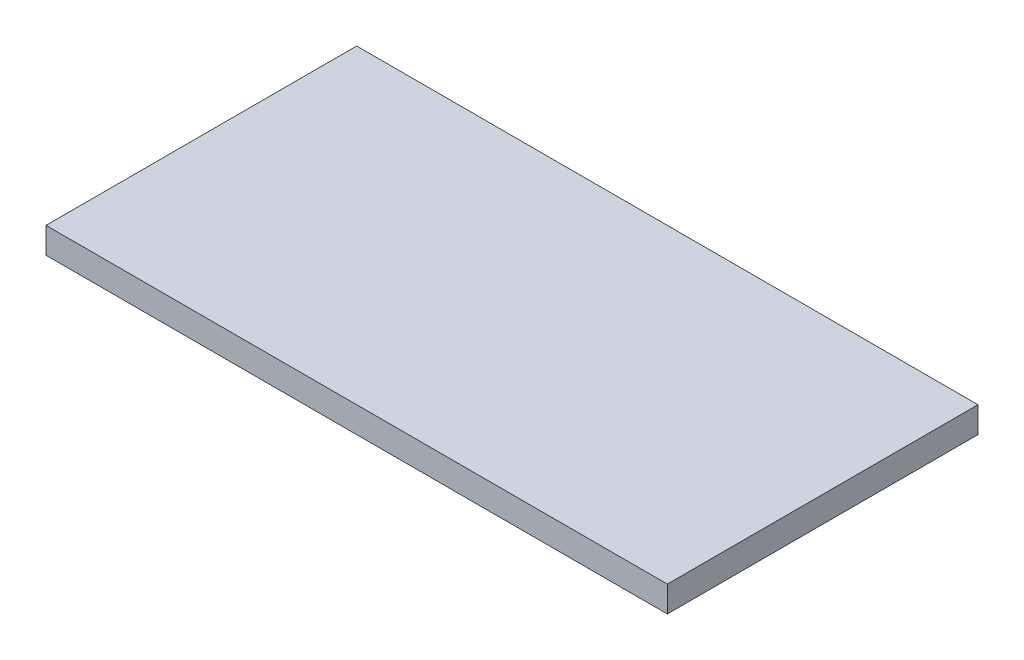
ISO-10303-21;
HEADER;
FILE_DESCRIPTION(('STEP AP214'),'2;1');
FILE_NAME('part.step','',(''),(''),'','','');
FILE_SCHEMA(('AUTOMOTIVE_DESIGN { 1 0 10303 214 1 1 1 1 }'));
ENDSEC;
DATA;
#1=APPLICATION_CONTEXT('core data for automotive mechanical design processes');
#2=APPLICATION_PROTOCOL_DEFINITION('international standard','automotive_design',2000,#1);
#3=PRODUCT_CONTEXT('',#1,'mechanical');
#4=PRODUCT('Part','Part','',(#3));
#5=PRODUCT_RELATED_PRODUCT_CATEGORY('part','',(#4));
#6=PRODUCT_DEFINITION_FORMATION('','',#4);
#7=PRODUCT_DEFINITION_CONTEXT('part definition',#1,'design');
#8=PRODUCT_DEFINITION('design','',#6,#7);
#9=PRODUCT_DEFINITION_SHAPE('','',#8);
#10=(LENGTH_UNIT() NAMED_UNIT(*) SI_UNIT(.MILLI.,.METRE.));
#11=(NAMED_UNIT(*) PLANE_ANGLE_UNIT() SI_UNIT($,.RADIAN.));
#12=(NAMED_UNIT(*) SI_UNIT($,.STERADIAN.) SOLID_ANGLE_UNIT());
#13=UNCERTAINTY_MEASURE_WITH_UNIT(LENGTH_MEASURE(1.E-05),#10,'distance_accuracy_value','');
#14=(GEOMETRIC_REPRESENTATION_CONTEXT(3) GLOBAL_UNCERTAINTY_ASSIGNED_CONTEXT((#13)) GLOBAL_UNIT_ASSIGNED_CONTEXT((#10,
#11,#12)) REPRESENTATION_CONTEXT('',''));
#15=CARTESIAN_POINT('',(0.,0.,0.));
#16=DIRECTION('',(0.,0.,1.));
#17=DIRECTION('',(1.,0.,0.));
#18=AXIS2_PLACEMENT_3D('',#15,#16,#17);
#19=CARTESIAN_POINT('',(-55.9960979463199,12.7,-128.876472888351));
#20=DIRECTION('',(1.,0.,0.));
#21=DIRECTION('',(0.,0.,-1.));
#22=AXIS2_PLACEMENT_3D('',#19,#20,#21);
#23=PLANE('',#22);
#24=DIRECTION('',(0.,0.,1.));
#25=VECTOR('',#24,1.);
#26=CARTESIAN_POINT('',(-55.9960979463199,0.,-128.876472888351));
#27=LINE('',#26,#25);
#28=CARTESIAN_POINT('',(-55.9960979463199,0.,-128.876472888351));
#29=VERTEX_POINT('',#28);
#30=CARTESIAN_POINT('',(-55.9960979463199,0.,23.5235271116494));
#31=VERTEX_POINT('',#30);
#32=EDGE_CURVE('E98',#29,#31,#27,.T.);
#33=ORIENTED_EDGE('',*,*,#32,.T.);
#34=DIRECTION('',(0.,-1.,0.));
#35=VECTOR('',#34,1.);
#36=CARTESIAN_POINT('',(-55.9960979463199,12.7,23.5235271116494));
#37=LINE('',#36,#35);
#38=CARTESIAN_POINT('',(-55.9960979463199,12.7,23.5235271116494));
#39=VERTEX_POINT('',#38);
#40=EDGE_CURVE('E11',#39,#31,#37,.T.);
#41=ORIENTED_EDGE('',*,*,#40,.F.);
#42=DIRECTION('',(0.,0.,1.));
#43=VECTOR('',#42,1.);
#44=CARTESIAN_POINT('',(-55.9960979463199,12.7,-128.876472888351));
#45=LINE('',#44,#43);
#46=CARTESIAN_POINT('',(-55.9960979463199,12.7,-128.876472888351));
#47=VERTEX_POINT('',#46);
#48=EDGE_CURVE('E86',#47,#39,#45,.T.);
#49=ORIENTED_EDGE('',*,*,#48,.F.);
#50=DIRECTION('',(0.,-1.,0.));
#51=VECTOR('',#50,1.);
#52=CARTESIAN_POINT('',(-55.9960979463199,12.7,-128.876472888351));
#53=LINE('',#52,#51);
#54=EDGE_CURVE('E94',#47,#29,#53,.T.);
#55=ORIENTED_EDGE('',*,*,#54,.T.);
#56=EDGE_LOOP('',(#33,#41,#49,#55));
#57=FACE_BOUND('',#56,.T.);
#58=ADVANCED_FACE('F35',(#57),#23,.F.);
#59=CARTESIAN_POINT('',(-55.9960979463199,12.7,23.5235271116494));
#60=DIRECTION('',(0.,0.,-1.));
#61=DIRECTION('',(-1.,0.,0.));
#62=AXIS2_PLACEMENT_3D('',#59,#60,#61);
#63=PLANE('',#62);
#64=DIRECTION('',(1.,0.,0.));
#65=VECTOR('',#64,1.);
#66=CARTESIAN_POINT('',(-55.9960979463199,0.,23.5235271116494));
#67=LINE('',#66,#65);
#68=CARTESIAN_POINT('',(248.80390205368,0.,23.5235271116494));
#69=VERTEX_POINT('',#68);
#70=EDGE_CURVE('E90',#31,#69,#67,.T.);
#71=ORIENTED_EDGE('',*,*,#70,.T.);
#72=DIRECTION('',(0.,-1.,0.));
#73=VECTOR('',#72,1.);
#74=CARTESIAN_POINT('',(248.80390205368,12.7,23.5235271116494));
#75=LINE('',#74,#73);
#76=CARTESIAN_POINT('',(248.80390205368,12.7,23.5235271116494));
#77=VERTEX_POINT('',#76);
#78=EDGE_CURVE('E43',#77,#69,#75,.T.);
#79=ORIENTED_EDGE('',*,*,#78,.F.);
#80=DIRECTION('',(1.,0.,0.));
#81=VECTOR('',#80,1.);
#82=CARTESIAN_POINT('',(-55.9960979463199,12.7,23.5235271116494));
#83=LINE('',#82,#81);
#84=EDGE_CURVE('E81',#39,#77,#83,.T.);
#85=ORIENTED_EDGE('',*,*,#84,.F.);
#86=ORIENTED_EDGE('',*,*,#40,.T.);
#87=EDGE_LOOP('',(#71,#79,#85,#86));
#88=FACE_BOUND('',#87,.T.);
#89=ADVANCED_FACE('F89',(#88),#63,.F.);
#90=CARTESIAN_POINT('',(248.80390205368,12.7,-128.876472888351));
#91=DIRECTION('',(-1.,0.,0.));
#92=DIRECTION('',(0.,0.,1.));
#93=AXIS2_PLACEMENT_3D('',#90,#91,#92);
#94=PLANE('',#93);
#95=DIRECTION('',(0.,0.,-1.));
#96=VECTOR('',#95,1.);
#97=CARTESIAN_POINT('',(248.80390205368,0.,-128.876472888351));
#98=LINE('',#97,#96);
#99=CARTESIAN_POINT('',(248.80390205368,0.,-128.876472888351));
#100=VERTEX_POINT('',#99);
#101=EDGE_CURVE('E68',#69,#100,#98,.T.);
#102=ORIENTED_EDGE('',*,*,#101,.T.);
#103=DIRECTION('',(0.,-1.,0.));
#104=VECTOR('',#103,1.);
#105=CARTESIAN_POINT('',(248.80390205368,12.7,-128.876472888351));
#106=LINE('',#105,#104);
#107=CARTESIAN_POINT('',(248.80390205368,12.7,-128.876472888351));
#108=VERTEX_POINT('',#107);
#109=EDGE_CURVE('E91',#108,#100,#106,.T.);
#110=ORIENTED_EDGE('',*,*,#109,.F.);
#111=DIRECTION('',(0.,0.,-1.));
#112=VECTOR('',#111,1.);
#113=CARTESIAN_POINT('',(248.80390205368,12.7,-128.876472888351));
#114=LINE('',#113,#112);
#115=EDGE_CURVE('E84',#77,#108,#114,.T.);
#116=ORIENTED_EDGE('',*,*,#115,.F.);
#117=ORIENTED_EDGE('',*,*,#78,.T.);
#118=EDGE_LOOP('',(#102,#110,#116,#117));
#119=FACE_BOUND('',#118,.T.);
#120=ADVANCED_FACE('F92',(#119),#94,.F.);
#121=CARTESIAN_POINT('',(-55.9960979463199,12.7,-128.876472888351));
#122=DIRECTION('',(0.,0.,1.));
#123=DIRECTION('',(1.,0.,0.));
#124=AXIS2_PLACEMENT_3D('',#121,#122,#123);
#125=PLANE('',#124);
#126=DIRECTION('',(-1.,0.,0.));
#127=VECTOR('',#126,1.);
#128=CARTESIAN_POINT('',(-55.9960979463199,0.,-128.876472888351));
#129=LINE('',#128,#127);
#130=EDGE_CURVE('E74',#100,#29,#129,.T.);
#131=ORIENTED_EDGE('',*,*,#130,.T.);
#132=ORIENTED_EDGE('',*,*,#54,.F.);
#133=DIRECTION('',(-1.,0.,0.));
#134=VECTOR('',#133,1.);
#135=CARTESIAN_POINT('',(-55.9960979463199,12.7,-128.876472888351));
#136=LINE('',#135,#134);
#137=EDGE_CURVE('E51',#108,#47,#136,.T.);
#138=ORIENTED_EDGE('',*,*,#137,.F.);
#139=ORIENTED_EDGE('',*,*,#109,.T.);
#140=EDGE_LOOP('',(#131,#132,#138,#139));
#141=FACE_BOUND('',#140,.T.);
#142=ADVANCED_FACE('F105',(#141),#125,.F.);
#143=CARTESIAN_POINT('',(0.,12.7,0.));
#144=DIRECTION('',(0.,1.,0.));
#145=DIRECTION('',(0.,0.,1.));
#146=AXIS2_PLACEMENT_3D('',#143,#144,#145);
#147=PLANE('',#146);
#148=ORIENTED_EDGE('',*,*,#48,.T.);
#149=ORIENTED_EDGE('',*,*,#84,.T.);
#150=ORIENTED_EDGE('',*,*,#115,.T.);
#151=ORIENTED_EDGE('',*,*,#137,.T.);
#152=EDGE_LOOP('',(#148,#149,#150,#151));
#153=FACE_BOUND('',#152,.T.);
#154=ADVANCED_FACE('F82',(#153),#147,.T.);
#155=CARTESIAN_POINT('',(0.,0.,0.));
#156=DIRECTION('',(0.,1.,0.));
#157=DIRECTION('',(0.,0.,1.));
#158=AXIS2_PLACEMENT_3D('',#155,#156,#157);
#159=PLANE('',#158);
#160=ORIENTED_EDGE('',*,*,#32,.F.);
#161=ORIENTED_EDGE('',*,*,#130,.F.);
#162=ORIENTED_EDGE('',*,*,#101,.F.);
#163=ORIENTED_EDGE('',*,*,#70,.F.);
#164=EDGE_LOOP('',(#160,#161,#162,#163));
#165=FACE_BOUND('',#164,.T.);
#166=ADVANCED_FACE('F108',(#165),#159,.F.);
#167=CLOSED_SHELL('',(#58,#89,#120,#142,#154,#166));
#168=MANIFOLD_SOLID_BREP('B2',#167);
#169=ADVANCED_BREP_SHAPE_REPRESENTATION('',(#18,#168),#14);
#170=SHAPE_DEFINITION_REPRESENTATION(#9,#169);
ENDSEC;
END-ISO-10303-21;
